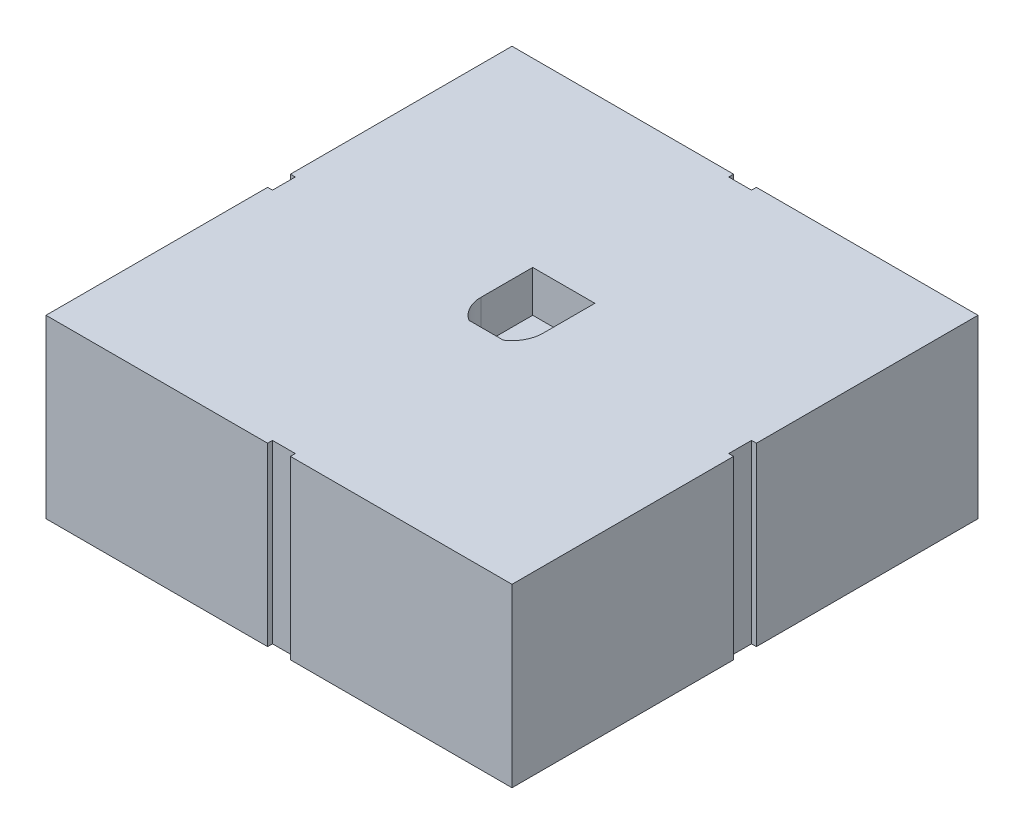
ISO-10303-21;
HEADER;
FILE_DESCRIPTION(('STEP AP214'),'2;1');
FILE_NAME('part.step','',(''),(''),'','','');
FILE_SCHEMA(('AUTOMOTIVE_DESIGN { 1 0 10303 214 1 1 1 1 }'));
ENDSEC;
DATA;
#1=APPLICATION_CONTEXT('core data for automotive mechanical design processes');
#2=APPLICATION_PROTOCOL_DEFINITION('international standard','automotive_design',2000,#1);
#3=PRODUCT_CONTEXT('',#1,'mechanical');
#4=PRODUCT('Part','Part','',(#3));
#5=PRODUCT_RELATED_PRODUCT_CATEGORY('part','',(#4));
#6=PRODUCT_DEFINITION_FORMATION('','',#4);
#7=PRODUCT_DEFINITION_CONTEXT('part definition',#1,'design');
#8=PRODUCT_DEFINITION('design','',#6,#7);
#9=PRODUCT_DEFINITION_SHAPE('','',#8);
#10=(LENGTH_UNIT() NAMED_UNIT(*) SI_UNIT(.MILLI.,.METRE.));
#11=(NAMED_UNIT(*) PLANE_ANGLE_UNIT() SI_UNIT($,.RADIAN.));
#12=(NAMED_UNIT(*) SI_UNIT($,.STERADIAN.) SOLID_ANGLE_UNIT());
#13=UNCERTAINTY_MEASURE_WITH_UNIT(LENGTH_MEASURE(1.E-05),#10,'distance_accuracy_value','');
#14=(GEOMETRIC_REPRESENTATION_CONTEXT(3) GLOBAL_UNCERTAINTY_ASSIGNED_CONTEXT((#13)) GLOBAL_UNIT_ASSIGNED_CONTEXT((#10,
#11,#12)) REPRESENTATION_CONTEXT('',''));
#15=CARTESIAN_POINT('',(0.,0.,0.));
#16=DIRECTION('',(0.,0.,1.));
#17=DIRECTION('',(1.,0.,0.));
#18=AXIS2_PLACEMENT_3D('',#15,#16,#17);
#19=CARTESIAN_POINT('',(0.,54.,0.));
#20=DIRECTION('',(1.,0.,0.));
#21=DIRECTION('',(0.,0.,-1.));
#22=AXIS2_PLACEMENT_3D('',#19,#20,#21);
#23=PLANE('',#22);
#24=DIRECTION('',(0.,0.,1.));
#25=VECTOR('',#24,1.);
#26=CARTESIAN_POINT('',(0.,54.,0.));
#27=LINE('',#26,#25);
#28=CARTESIAN_POINT('',(0.,54.,-67.9000000000008));
#29=VERTEX_POINT('',#28);
#30=CARTESIAN_POINT('',(0.,54.,0.));
#31=VERTEX_POINT('',#30);
#32=EDGE_CURVE('E278',#29,#31,#27,.T.);
#33=ORIENTED_EDGE('',*,*,#32,.F.);
#34=DIRECTION('',(0.,-1.,0.));
#35=VECTOR('',#34,1.);
#36=CARTESIAN_POINT('',(0.,54.,-67.9000000000008));
#37=LINE('',#36,#35);
#38=CARTESIAN_POINT('',(0.,0.,-67.9000000000008));
#39=VERTEX_POINT('',#38);
#40=EDGE_CURVE('E336',#29,#39,#37,.T.);
#41=ORIENTED_EDGE('',*,*,#40,.T.);
#42=DIRECTION('',(0.,0.,1.));
#43=VECTOR('',#42,1.);
#44=CARTESIAN_POINT('',(0.,0.,0.));
#45=LINE('',#44,#43);
#46=CARTESIAN_POINT('',(0.,0.,0.));
#47=VERTEX_POINT('',#46);
#48=EDGE_CURVE('E265',#39,#47,#45,.T.);
#49=ORIENTED_EDGE('',*,*,#48,.T.);
#50=DIRECTION('',(0.,-1.,0.));
#51=VECTOR('',#50,1.);
#52=CARTESIAN_POINT('',(0.,54.,0.));
#53=LINE('',#52,#51);
#54=EDGE_CURVE('E11',#31,#47,#53,.T.);
#55=ORIENTED_EDGE('',*,*,#54,.F.);
#56=EDGE_LOOP('',(#33,#41,#49,#55));
#57=FACE_BOUND('',#56,.T.);
#58=ADVANCED_FACE('F39',(#57),#23,.F.);
#59=CARTESIAN_POINT('',(0.,54.,0.));
#60=DIRECTION('',(0.,0.,-1.));
#61=DIRECTION('',(-1.,0.,0.));
#62=AXIS2_PLACEMENT_3D('',#59,#60,#61);
#63=PLANE('',#62);
#64=DIRECTION('',(1.,0.,0.));
#65=VECTOR('',#64,1.);
#66=CARTESIAN_POINT('',(0.,54.,0.));
#67=LINE('',#66,#65);
#68=CARTESIAN_POINT('',(74.9,54.,0.));
#69=VERTEX_POINT('',#68);
#70=CARTESIAN_POINT('',(142.8,54.,0.));
#71=VERTEX_POINT('',#70);
#72=EDGE_CURVE('E243',#69,#71,#67,.T.);
#73=ORIENTED_EDGE('',*,*,#72,.F.);
#74=DIRECTION('',(0.,-1.,0.));
#75=VECTOR('',#74,1.);
#76=CARTESIAN_POINT('',(74.9,54.,0.));
#77=LINE('',#76,#75);
#78=CARTESIAN_POINT('',(74.9,0.,0.));
#79=VERTEX_POINT('',#78);
#80=EDGE_CURVE('E297',#69,#79,#77,.T.);
#81=ORIENTED_EDGE('',*,*,#80,.T.);
#82=DIRECTION('',(1.,0.,0.));
#83=VECTOR('',#82,1.);
#84=CARTESIAN_POINT('',(0.,0.,0.));
#85=LINE('',#84,#83);
#86=CARTESIAN_POINT('',(142.8,0.,0.));
#87=VERTEX_POINT('',#86);
#88=EDGE_CURVE('E264',#79,#87,#85,.T.);
#89=ORIENTED_EDGE('',*,*,#88,.T.);
#90=DIRECTION('',(0.,-1.,0.));
#91=VECTOR('',#90,1.);
#92=CARTESIAN_POINT('',(142.8,54.,0.));
#93=LINE('',#92,#91);
#94=EDGE_CURVE('E48',#71,#87,#93,.T.);
#95=ORIENTED_EDGE('',*,*,#94,.F.);
#96=EDGE_LOOP('',(#73,#81,#89,#95));
#97=FACE_BOUND('',#96,.T.);
#98=ADVANCED_FACE('F507',(#97),#63,.F.);
#99=CARTESIAN_POINT('',(142.8,54.,0.));
#100=DIRECTION('',(-1.,0.,0.));
#101=DIRECTION('',(0.,0.,1.));
#102=AXIS2_PLACEMENT_3D('',#99,#100,#101);
#103=PLANE('',#102);
#104=DIRECTION('',(0.,0.,-1.));
#105=VECTOR('',#104,1.);
#106=CARTESIAN_POINT('',(142.8,54.,0.));
#107=LINE('',#106,#105);
#108=CARTESIAN_POINT('',(142.8,54.,-74.8999999999998));
#109=VERTEX_POINT('',#108);
#110=CARTESIAN_POINT('',(142.8,54.,-142.8));
#111=VERTEX_POINT('',#110);
#112=EDGE_CURVE('E247',#109,#111,#107,.T.);
#113=ORIENTED_EDGE('',*,*,#112,.F.);
#114=DIRECTION('',(0.,-1.,0.));
#115=VECTOR('',#114,1.);
#116=CARTESIAN_POINT('',(142.8,54.,-74.8999999999998));
#117=LINE('',#116,#115);
#118=CARTESIAN_POINT('',(142.8,0.,-74.8999999999998));
#119=VERTEX_POINT('',#118);
#120=EDGE_CURVE('E310',#109,#119,#117,.T.);
#121=ORIENTED_EDGE('',*,*,#120,.T.);
#122=DIRECTION('',(0.,0.,-1.));
#123=VECTOR('',#122,1.);
#124=CARTESIAN_POINT('',(142.8,0.,0.));
#125=LINE('',#124,#123);
#126=CARTESIAN_POINT('',(142.8,0.,-142.8));
#127=VERTEX_POINT('',#126);
#128=EDGE_CURVE('E270',#119,#127,#125,.T.);
#129=ORIENTED_EDGE('',*,*,#128,.T.);
#130=DIRECTION('',(0.,-1.,0.));
#131=VECTOR('',#130,1.);
#132=CARTESIAN_POINT('',(142.8,54.,-142.8));
#133=LINE('',#132,#131);
#134=EDGE_CURVE('E282',#111,#127,#133,.T.);
#135=ORIENTED_EDGE('',*,*,#134,.F.);
#136=EDGE_LOOP('',(#113,#121,#129,#135));
#137=FACE_BOUND('',#136,.T.);
#138=ADVANCED_FACE('F524',(#137),#103,.F.);
#139=CARTESIAN_POINT('',(0.,54.,-142.8));
#140=DIRECTION('',(0.,0.,1.));
#141=DIRECTION('',(1.,0.,0.));
#142=AXIS2_PLACEMENT_3D('',#139,#140,#141);
#143=PLANE('',#142);
#144=DIRECTION('',(-1.,0.,0.));
#145=VECTOR('',#144,1.);
#146=CARTESIAN_POINT('',(0.,54.,-142.8));
#147=LINE('',#146,#145);
#148=CARTESIAN_POINT('',(67.9,54.,-142.8));
#149=VERTEX_POINT('',#148);
#150=CARTESIAN_POINT('',(0.,54.,-142.8));
#151=VERTEX_POINT('',#150);
#152=EDGE_CURVE('E246',#149,#151,#147,.T.);
#153=ORIENTED_EDGE('',*,*,#152,.F.);
#154=DIRECTION('',(0.,-1.,0.));
#155=VECTOR('',#154,1.);
#156=CARTESIAN_POINT('',(67.9,54.,-142.8));
#157=LINE('',#156,#155);
#158=CARTESIAN_POINT('',(67.9,0.,-142.8));
#159=VERTEX_POINT('',#158);
#160=EDGE_CURVE('E405',#149,#159,#157,.T.);
#161=ORIENTED_EDGE('',*,*,#160,.T.);
#162=DIRECTION('',(-1.,0.,0.));
#163=VECTOR('',#162,1.);
#164=CARTESIAN_POINT('',(0.,0.,-142.8));
#165=LINE('',#164,#163);
#166=CARTESIAN_POINT('',(0.,0.,-142.8));
#167=VERTEX_POINT('',#166);
#168=EDGE_CURVE('E273',#159,#167,#165,.T.);
#169=ORIENTED_EDGE('',*,*,#168,.T.);
#170=DIRECTION('',(0.,-1.,0.));
#171=VECTOR('',#170,1.);
#172=CARTESIAN_POINT('',(0.,54.,-142.8));
#173=LINE('',#172,#171);
#174=EDGE_CURVE('E259',#151,#167,#173,.T.);
#175=ORIENTED_EDGE('',*,*,#174,.F.);
#176=EDGE_LOOP('',(#153,#161,#169,#175));
#177=FACE_BOUND('',#176,.T.);
#178=ADVANCED_FACE('F526',(#177),#143,.F.);
#179=CARTESIAN_POINT('',(0.,0.,-74.9000000000008));
#180=VERTEX_POINT('',#179);
#181=EDGE_CURVE('E260',#167,#180,#45,.T.);
#182=ORIENTED_EDGE('',*,*,#181,.T.);
#183=DIRECTION('',(0.,-1.,0.));
#184=VECTOR('',#183,1.);
#185=CARTESIAN_POINT('',(0.,54.,-74.9000000000008));
#186=LINE('',#185,#184);
#187=CARTESIAN_POINT('',(0.,54.,-74.9000000000008));
#188=VERTEX_POINT('',#187);
#189=EDGE_CURVE('E55',#188,#180,#186,.T.);
#190=ORIENTED_EDGE('',*,*,#189,.F.);
#191=EDGE_CURVE('E481',#151,#188,#27,.T.);
#192=ORIENTED_EDGE('',*,*,#191,.F.);
#193=ORIENTED_EDGE('',*,*,#174,.T.);
#194=EDGE_LOOP('',(#182,#190,#192,#193));
#195=FACE_BOUND('',#194,.T.);
#196=ADVANCED_FACE('F41',(#195),#23,.F.);
#197=CARTESIAN_POINT('',(67.8999999999999,0.,0.));
#198=VERTEX_POINT('',#197);
#199=EDGE_CURVE('E266',#47,#198,#85,.T.);
#200=ORIENTED_EDGE('',*,*,#199,.T.);
#201=DIRECTION('',(0.,-1.,0.));
#202=VECTOR('',#201,1.);
#203=CARTESIAN_POINT('',(67.9,54.,0.));
#204=LINE('',#203,#202);
#205=CARTESIAN_POINT('',(67.9,54.,0.));
#206=VERTEX_POINT('',#205);
#207=EDGE_CURVE('E63',#206,#198,#204,.T.);
#208=ORIENTED_EDGE('',*,*,#207,.F.);
#209=EDGE_CURVE('E253',#31,#206,#67,.T.);
#210=ORIENTED_EDGE('',*,*,#209,.F.);
#211=ORIENTED_EDGE('',*,*,#54,.T.);
#212=EDGE_LOOP('',(#200,#208,#210,#211));
#213=FACE_BOUND('',#212,.T.);
#214=ADVANCED_FACE('F494',(#213),#63,.F.);
#215=CARTESIAN_POINT('',(142.8,0.,-67.8999999999997));
#216=VERTEX_POINT('',#215);
#217=EDGE_CURVE('E236',#87,#216,#125,.T.);
#218=ORIENTED_EDGE('',*,*,#217,.T.);
#219=DIRECTION('',(0.,-1.,0.));
#220=VECTOR('',#219,1.);
#221=CARTESIAN_POINT('',(142.8,54.,-67.8999999999997));
#222=LINE('',#221,#220);
#223=CARTESIAN_POINT('',(142.8,54.,-67.8999999999997));
#224=VERTEX_POINT('',#223);
#225=EDGE_CURVE('E218',#224,#216,#222,.T.);
#226=ORIENTED_EDGE('',*,*,#225,.F.);
#227=EDGE_CURVE('E234',#71,#224,#107,.T.);
#228=ORIENTED_EDGE('',*,*,#227,.F.);
#229=ORIENTED_EDGE('',*,*,#94,.T.);
#230=EDGE_LOOP('',(#218,#226,#228,#229));
#231=FACE_BOUND('',#230,.T.);
#232=ADVANCED_FACE('F232',(#231),#103,.F.);
#233=CARTESIAN_POINT('',(74.9,0.,-142.8));
#234=VERTEX_POINT('',#233);
#235=EDGE_CURVE('E274',#127,#234,#165,.T.);
#236=ORIENTED_EDGE('',*,*,#235,.T.);
#237=DIRECTION('',(0.,-1.,0.));
#238=VECTOR('',#237,1.);
#239=CARTESIAN_POINT('',(74.9,54.,-142.8));
#240=LINE('',#239,#238);
#241=CARTESIAN_POINT('',(74.9,54.,-142.8));
#242=VERTEX_POINT('',#241);
#243=EDGE_CURVE('E395',#242,#234,#240,.T.);
#244=ORIENTED_EDGE('',*,*,#243,.F.);
#245=EDGE_CURVE('E251',#111,#242,#147,.T.);
#246=ORIENTED_EDGE('',*,*,#245,.F.);
#247=ORIENTED_EDGE('',*,*,#134,.T.);
#248=EDGE_LOOP('',(#236,#244,#246,#247));
#249=FACE_BOUND('',#248,.T.);
#250=ADVANCED_FACE('F534',(#249),#143,.F.);
#251=CARTESIAN_POINT('',(0.,54.,0.));
#252=DIRECTION('',(0.,-1.,0.));
#253=DIRECTION('',(0.,0.,-1.));
#254=AXIS2_PLACEMENT_3D('',#251,#252,#253);
#255=PLANE('',#254);
#256=DIRECTION('',(1.,0.,0.));
#257=VECTOR('',#256,1.);
#258=CARTESIAN_POINT('',(0.,54.,-63.4625));
#259=LINE('',#258,#257);
#260=CARTESIAN_POINT('',(66.1348581453108,54.,-63.4625));
#261=VERTEX_POINT('',#260);
#262=CARTESIAN_POINT('',(76.6651418546892,54.,-63.4625));
#263=VERTEX_POINT('',#262);
#264=EDGE_CURVE('E445',#261,#263,#259,.T.);
#265=ORIENTED_EDGE('',*,*,#264,.F.);
#266=CARTESIAN_POINT('',(71.4,54.,-71.4));
#267=DIRECTION('',(0.,1.,0.));
#268=DIRECTION('',(0.,0.,1.));
#269=AXIS2_PLACEMENT_3D('',#266,#267,#268);
#270=CIRCLE('',#269,9.52500000000001);
#271=CARTESIAN_POINT('',(61.875,54.,-71.4));
#272=VERTEX_POINT('',#271);
#273=EDGE_CURVE('E409',#272,#261,#270,.T.);
#274=ORIENTED_EDGE('',*,*,#273,.F.);
#275=DIRECTION('',(0.,0.,-1.));
#276=VECTOR('',#275,1.);
#277=CARTESIAN_POINT('',(61.875,54.,0.));
#278=LINE('',#277,#276);
#279=CARTESIAN_POINT('',(61.875,54.,-87.275));
#280=VERTEX_POINT('',#279);
#281=EDGE_CURVE('E423',#272,#280,#278,.T.);
#282=ORIENTED_EDGE('',*,*,#281,.T.);
#283=DIRECTION('',(-1.,0.,0.));
#284=VECTOR('',#283,1.);
#285=CARTESIAN_POINT('',(0.,54.,-87.275));
#286=LINE('',#285,#284);
#287=CARTESIAN_POINT('',(80.925,54.,-87.275));
#288=VERTEX_POINT('',#287);
#289=EDGE_CURVE('E457',#288,#280,#286,.T.);
#290=ORIENTED_EDGE('',*,*,#289,.F.);
#291=DIRECTION('',(0.,0.,-1.));
#292=VECTOR('',#291,1.);
#293=CARTESIAN_POINT('',(80.925,54.,0.));
#294=LINE('',#293,#292);
#295=CARTESIAN_POINT('',(80.925,54.,-71.4));
#296=VERTEX_POINT('',#295);
#297=EDGE_CURVE('E453',#296,#288,#294,.T.);
#298=ORIENTED_EDGE('',*,*,#297,.F.);
#299=CARTESIAN_POINT('',(71.4,54.,-71.4));
#300=DIRECTION('',(0.,1.,0.));
#301=DIRECTION('',(0.,0.,1.));
#302=AXIS2_PLACEMENT_3D('',#299,#300,#301);
#303=CIRCLE('',#302,9.52500000000001);
#304=EDGE_CURVE('E449',#263,#296,#303,.T.);
#305=ORIENTED_EDGE('',*,*,#304,.F.);
#306=EDGE_LOOP('',(#265,#274,#282,#290,#298,#305));
#307=FACE_BOUND('',#306,.T.);
#308=DIRECTION('',(0.,0.,-1.));
#309=VECTOR('',#308,1.);
#310=CARTESIAN_POINT('',(141.3,54.,-71.3999999999997));
#311=LINE('',#310,#309);
#312=CARTESIAN_POINT('',(141.3,54.,-67.8999999999997));
#313=VERTEX_POINT('',#312);
#314=CARTESIAN_POINT('',(141.3,54.,-74.8999999999998));
#315=VERTEX_POINT('',#314);
#316=EDGE_CURVE('E226',#313,#315,#311,.T.);
#317=ORIENTED_EDGE('',*,*,#316,.T.);
#318=DIRECTION('',(1.,0.,0.));
#319=VECTOR('',#318,1.);
#320=CARTESIAN_POINT('',(142.8,54.,-74.8999999999998));
#321=LINE('',#320,#319);
#322=EDGE_CURVE('E238',#315,#109,#321,.T.);
#323=ORIENTED_EDGE('',*,*,#322,.T.);
#324=ORIENTED_EDGE('',*,*,#112,.T.);
#325=ORIENTED_EDGE('',*,*,#245,.T.);
#326=DIRECTION('',(0.,0.,1.));
#327=VECTOR('',#326,1.);
#328=CARTESIAN_POINT('',(74.9,54.,-142.8));
#329=LINE('',#328,#327);
#330=CARTESIAN_POINT('',(74.9,54.,-141.3));
#331=VERTEX_POINT('',#330);
#332=EDGE_CURVE('E382',#242,#331,#329,.T.);
#333=ORIENTED_EDGE('',*,*,#332,.T.);
#334=DIRECTION('',(-1.,0.,0.));
#335=VECTOR('',#334,1.);
#336=CARTESIAN_POINT('',(71.4,54.,-141.3));
#337=LINE('',#336,#335);
#338=CARTESIAN_POINT('',(67.9,54.,-141.3));
#339=VERTEX_POINT('',#338);
#340=EDGE_CURVE('E386',#331,#339,#337,.T.);
#341=ORIENTED_EDGE('',*,*,#340,.T.);
#342=DIRECTION('',(0.,0.,-1.));
#343=VECTOR('',#342,1.);
#344=CARTESIAN_POINT('',(67.9,54.,-142.8));
#345=LINE('',#344,#343);
#346=EDGE_CURVE('E391',#339,#149,#345,.T.);
#347=ORIENTED_EDGE('',*,*,#346,.T.);
#348=ORIENTED_EDGE('',*,*,#152,.T.);
#349=ORIENTED_EDGE('',*,*,#191,.T.);
#350=DIRECTION('',(1.,0.,0.));
#351=VECTOR('',#350,1.);
#352=CARTESIAN_POINT('',(0.,54.,-74.9000000000008));
#353=LINE('',#352,#351);
#354=CARTESIAN_POINT('',(1.50000000000006,54.,-74.9000000000008));
#355=VERTEX_POINT('',#354);
#356=EDGE_CURVE('E349',#188,#355,#353,.T.);
#357=ORIENTED_EDGE('',*,*,#356,.T.);
#358=DIRECTION('',(0.,0.,1.));
#359=VECTOR('',#358,1.);
#360=CARTESIAN_POINT('',(1.50000000000003,54.,-71.4000000000008));
#361=LINE('',#360,#359);
#362=CARTESIAN_POINT('',(1.5,54.,-67.9000000000008));
#363=VERTEX_POINT('',#362);
#364=EDGE_CURVE('E353',#355,#363,#361,.T.);
#365=ORIENTED_EDGE('',*,*,#364,.T.);
#366=DIRECTION('',(-1.,0.,0.));
#367=VECTOR('',#366,1.);
#368=CARTESIAN_POINT('',(0.,54.,-67.9000000000008));
#369=LINE('',#368,#367);
#370=EDGE_CURVE('E358',#363,#29,#369,.T.);
#371=ORIENTED_EDGE('',*,*,#370,.T.);
#372=ORIENTED_EDGE('',*,*,#32,.T.);
#373=ORIENTED_EDGE('',*,*,#209,.T.);
#374=DIRECTION('',(0.,0.,-1.));
#375=VECTOR('',#374,1.);
#376=CARTESIAN_POINT('',(67.9,54.,0.));
#377=LINE('',#376,#375);
#378=CARTESIAN_POINT('',(67.9,54.,-1.50000000000006));
#379=VERTEX_POINT('',#378);
#380=EDGE_CURVE('E320',#206,#379,#377,.T.);
#381=ORIENTED_EDGE('',*,*,#380,.T.);
#382=DIRECTION('',(1.,0.,0.));
#383=VECTOR('',#382,1.);
#384=CARTESIAN_POINT('',(71.4,54.,-1.50000000000006));
#385=LINE('',#384,#383);
#386=CARTESIAN_POINT('',(74.9,54.,-1.50000000000006));
#387=VERTEX_POINT('',#386);
#388=EDGE_CURVE('E324',#379,#387,#385,.T.);
#389=ORIENTED_EDGE('',*,*,#388,.T.);
#390=DIRECTION('',(0.,0.,1.));
#391=VECTOR('',#390,1.);
#392=CARTESIAN_POINT('',(74.9,54.,0.));
#393=LINE('',#392,#391);
#394=EDGE_CURVE('E329',#387,#69,#393,.T.);
#395=ORIENTED_EDGE('',*,*,#394,.T.);
#396=ORIENTED_EDGE('',*,*,#72,.T.);
#397=ORIENTED_EDGE('',*,*,#227,.T.);
#398=DIRECTION('',(-1.,0.,0.));
#399=VECTOR('',#398,1.);
#400=CARTESIAN_POINT('',(142.8,54.,-67.8999999999997));
#401=LINE('',#400,#399);
#402=EDGE_CURVE('E214',#224,#313,#401,.T.);
#403=ORIENTED_EDGE('',*,*,#402,.T.);
#404=EDGE_LOOP('',(#317,#323,#324,#325,#333,#341,#347,#348,#349,#357,#365,#371,#372,#373,#381,
#389,#395,#396,#397,#403));
#405=FACE_BOUND('',#404,.T.);
#406=ADVANCED_FACE('F240',(#307,#405),#255,.F.);
#407=CARTESIAN_POINT('',(0.,0.,0.));
#408=DIRECTION('',(0.,-1.,0.));
#409=DIRECTION('',(0.,0.,-1.));
#410=AXIS2_PLACEMENT_3D('',#407,#408,#409);
#411=PLANE('',#410);
#412=DIRECTION('',(1.,0.,0.));
#413=VECTOR('',#412,1.);
#414=CARTESIAN_POINT('',(142.8,0.,-74.8999999999998));
#415=LINE('',#414,#413);
#416=CARTESIAN_POINT('',(141.3,0.,-74.8999999999998));
#417=VERTEX_POINT('',#416);
#418=EDGE_CURVE('E227',#417,#119,#415,.T.);
#419=ORIENTED_EDGE('',*,*,#418,.F.);
#420=DIRECTION('',(0.,0.,-1.));
#421=VECTOR('',#420,1.);
#422=CARTESIAN_POINT('',(141.3,0.,-71.3999999999997));
#423=LINE('',#422,#421);
#424=CARTESIAN_POINT('',(141.3,0.,-67.8999999999997));
#425=VERTEX_POINT('',#424);
#426=EDGE_CURVE('E295',#425,#417,#423,.T.);
#427=ORIENTED_EDGE('',*,*,#426,.F.);
#428=DIRECTION('',(-1.,0.,0.));
#429=VECTOR('',#428,1.);
#430=CARTESIAN_POINT('',(142.8,0.,-67.8999999999997));
#431=LINE('',#430,#429);
#432=EDGE_CURVE('E293',#216,#425,#431,.T.);
#433=ORIENTED_EDGE('',*,*,#432,.F.);
#434=ORIENTED_EDGE('',*,*,#217,.F.);
#435=ORIENTED_EDGE('',*,*,#88,.F.);
#436=DIRECTION('',(0.,0.,1.));
#437=VECTOR('',#436,1.);
#438=CARTESIAN_POINT('',(74.9,0.,0.));
#439=LINE('',#438,#437);
#440=CARTESIAN_POINT('',(74.9,0.,-1.50000000000006));
#441=VERTEX_POINT('',#440);
#442=EDGE_CURVE('E325',#441,#79,#439,.T.);
#443=ORIENTED_EDGE('',*,*,#442,.F.);
#444=DIRECTION('',(1.,0.,0.));
#445=VECTOR('',#444,1.);
#446=CARTESIAN_POINT('',(71.4,0.,-1.50000000000006));
#447=LINE('',#446,#445);
#448=CARTESIAN_POINT('',(67.9,0.,-1.50000000000006));
#449=VERTEX_POINT('',#448);
#450=EDGE_CURVE('E335',#449,#441,#447,.T.);
#451=ORIENTED_EDGE('',*,*,#450,.F.);
#452=DIRECTION('',(0.,0.,-1.));
#453=VECTOR('',#452,1.);
#454=CARTESIAN_POINT('',(67.9,0.,0.));
#455=LINE('',#454,#453);
#456=EDGE_CURVE('E332',#198,#449,#455,.T.);
#457=ORIENTED_EDGE('',*,*,#456,.F.);
#458=ORIENTED_EDGE('',*,*,#199,.F.);
#459=ORIENTED_EDGE('',*,*,#48,.F.);
#460=DIRECTION('',(-1.,0.,0.));
#461=VECTOR('',#460,1.);
#462=CARTESIAN_POINT('',(0.,0.,-67.9000000000008));
#463=LINE('',#462,#461);
#464=CARTESIAN_POINT('',(1.5,0.,-67.9000000000008));
#465=VERTEX_POINT('',#464);
#466=EDGE_CURVE('E354',#465,#39,#463,.T.);
#467=ORIENTED_EDGE('',*,*,#466,.F.);
#468=DIRECTION('',(0.,0.,1.));
#469=VECTOR('',#468,1.);
#470=CARTESIAN_POINT('',(1.50000000000003,0.,-71.4000000000008));
#471=LINE('',#470,#469);
#472=CARTESIAN_POINT('',(1.50000000000006,0.,-74.9000000000008));
#473=VERTEX_POINT('',#472);
#474=EDGE_CURVE('E365',#473,#465,#471,.T.);
#475=ORIENTED_EDGE('',*,*,#474,.F.);
#476=DIRECTION('',(1.,0.,0.));
#477=VECTOR('',#476,1.);
#478=CARTESIAN_POINT('',(0.,0.,-74.9000000000008));
#479=LINE('',#478,#477);
#480=EDGE_CURVE('E362',#180,#473,#479,.T.);
#481=ORIENTED_EDGE('',*,*,#480,.F.);
#482=ORIENTED_EDGE('',*,*,#181,.F.);
#483=ORIENTED_EDGE('',*,*,#168,.F.);
#484=DIRECTION('',(0.,0.,-1.));
#485=VECTOR('',#484,1.);
#486=CARTESIAN_POINT('',(67.9,0.,-142.8));
#487=LINE('',#486,#485);
#488=CARTESIAN_POINT('',(67.9,0.,-141.3));
#489=VERTEX_POINT('',#488);
#490=EDGE_CURVE('E387',#489,#159,#487,.T.);
#491=ORIENTED_EDGE('',*,*,#490,.F.);
#492=DIRECTION('',(-1.,0.,0.));
#493=VECTOR('',#492,1.);
#494=CARTESIAN_POINT('',(71.4,0.,-141.3));
#495=LINE('',#494,#493);
#496=CARTESIAN_POINT('',(74.9,0.,-141.3));
#497=VERTEX_POINT('',#496);
#498=EDGE_CURVE('E399',#497,#489,#495,.T.);
#499=ORIENTED_EDGE('',*,*,#498,.F.);
#500=DIRECTION('',(0.,0.,1.));
#501=VECTOR('',#500,1.);
#502=CARTESIAN_POINT('',(74.9,0.,-142.8));
#503=LINE('',#502,#501);
#504=EDGE_CURVE('E314',#234,#497,#503,.T.);
#505=ORIENTED_EDGE('',*,*,#504,.F.);
#506=ORIENTED_EDGE('',*,*,#235,.F.);
#507=ORIENTED_EDGE('',*,*,#128,.F.);
#508=EDGE_LOOP('',(#419,#427,#433,#434,#435,#443,#451,#457,#458,#459,#467,#475,#481,#482,#483,
#491,#499,#505,#506,#507));
#509=FACE_BOUND('',#508,.T.);
#510=ADVANCED_FACE('F290',(#509),#411,.T.);
#511=CARTESIAN_POINT('',(71.4,41.3,-71.4));
#512=DIRECTION('',(0.,1.,0.));
#513=DIRECTION('',(0.,0.,1.));
#514=AXIS2_PLACEMENT_3D('',#511,#512,#513);
#515=CYLINDRICAL_SURFACE('',#514,9.52500000000001);
#516=ORIENTED_EDGE('',*,*,#273,.T.);
#517=DIRECTION('',(0.,1.,0.));
#518=VECTOR('',#517,1.);
#519=CARTESIAN_POINT('',(66.1348581453108,41.3,-63.4625));
#520=LINE('',#519,#518);
#521=CARTESIAN_POINT('',(66.1348581453108,41.3,-63.4625));
#522=VERTEX_POINT('',#521);
#523=EDGE_CURVE('E442',#522,#261,#520,.T.);
#524=ORIENTED_EDGE('',*,*,#523,.F.);
#525=CARTESIAN_POINT('',(71.4,41.3,-71.4));
#526=DIRECTION('',(0.,1.,0.));
#527=DIRECTION('',(0.,0.,1.));
#528=AXIS2_PLACEMENT_3D('',#525,#526,#527);
#529=CIRCLE('',#528,9.52500000000001);
#530=CARTESIAN_POINT('',(61.875,41.3,-71.4));
#531=VERTEX_POINT('',#530);
#532=EDGE_CURVE('E418',#531,#522,#529,.T.);
#533=ORIENTED_EDGE('',*,*,#532,.F.);
#534=DIRECTION('',(0.,1.,0.));
#535=VECTOR('',#534,1.);
#536=CARTESIAN_POINT('',(61.875,41.3,-71.4));
#537=LINE('',#536,#535);
#538=EDGE_CURVE('E464',#531,#272,#537,.T.);
#539=ORIENTED_EDGE('',*,*,#538,.T.);
#540=EDGE_LOOP('',(#516,#524,#533,#539));
#541=FACE_BOUND('',#540,.T.);
#542=ADVANCED_FACE('F573',(#541),#515,.F.);
#543=CARTESIAN_POINT('',(61.875,41.3,0.));
#544=DIRECTION('',(1.,0.,0.));
#545=DIRECTION('',(0.,0.,-1.));
#546=AXIS2_PLACEMENT_3D('',#543,#544,#545);
#547=PLANE('',#546);
#548=ORIENTED_EDGE('',*,*,#281,.F.);
#549=ORIENTED_EDGE('',*,*,#538,.F.);
#550=DIRECTION('',(0.,0.,-1.));
#551=VECTOR('',#550,1.);
#552=CARTESIAN_POINT('',(61.875,41.3,0.));
#553=LINE('',#552,#551);
#554=CARTESIAN_POINT('',(61.875,41.3,-87.275));
#555=VERTEX_POINT('',#554);
#556=EDGE_CURVE('E439',#531,#555,#553,.T.);
#557=ORIENTED_EDGE('',*,*,#556,.T.);
#558=DIRECTION('',(0.,1.,0.));
#559=VECTOR('',#558,1.);
#560=CARTESIAN_POINT('',(61.875,41.3,-87.275));
#561=LINE('',#560,#559);
#562=EDGE_CURVE('E467',#555,#280,#561,.T.);
#563=ORIENTED_EDGE('',*,*,#562,.T.);
#564=EDGE_LOOP('',(#548,#549,#557,#563));
#565=FACE_BOUND('',#564,.T.);
#566=ADVANCED_FACE('F569',(#565),#547,.T.);
#567=CARTESIAN_POINT('',(0.,41.3,-87.275));
#568=DIRECTION('',(0.,0.,-1.));
#569=DIRECTION('',(-1.,0.,0.));
#570=AXIS2_PLACEMENT_3D('',#567,#568,#569);
#571=PLANE('',#570);
#572=ORIENTED_EDGE('',*,*,#289,.T.);
#573=ORIENTED_EDGE('',*,*,#562,.F.);
#574=DIRECTION('',(-1.,0.,0.));
#575=VECTOR('',#574,1.);
#576=CARTESIAN_POINT('',(0.,41.3,-87.275));
#577=LINE('',#576,#575);
#578=CARTESIAN_POINT('',(80.925,41.3,-87.275));
#579=VERTEX_POINT('',#578);
#580=EDGE_CURVE('E435',#579,#555,#577,.T.);
#581=ORIENTED_EDGE('',*,*,#580,.F.);
#582=DIRECTION('',(0.,1.,0.));
#583=VECTOR('',#582,1.);
#584=CARTESIAN_POINT('',(80.925,41.3,-87.275));
#585=LINE('',#584,#583);
#586=EDGE_CURVE('E470',#579,#288,#585,.T.);
#587=ORIENTED_EDGE('',*,*,#586,.T.);
#588=EDGE_LOOP('',(#572,#573,#581,#587));
#589=FACE_BOUND('',#588,.T.);
#590=ADVANCED_FACE('F572',(#589),#571,.F.);
#591=CARTESIAN_POINT('',(80.925,41.3,0.));
#592=DIRECTION('',(1.,0.,0.));
#593=DIRECTION('',(0.,0.,-1.));
#594=AXIS2_PLACEMENT_3D('',#591,#592,#593);
#595=PLANE('',#594);
#596=ORIENTED_EDGE('',*,*,#297,.T.);
#597=ORIENTED_EDGE('',*,*,#586,.F.);
#598=DIRECTION('',(0.,0.,-1.));
#599=VECTOR('',#598,1.);
#600=CARTESIAN_POINT('',(80.925,41.3,0.));
#601=LINE('',#600,#599);
#602=CARTESIAN_POINT('',(80.925,41.3,-71.4));
#603=VERTEX_POINT('',#602);
#604=EDGE_CURVE('E431',#603,#579,#601,.T.);
#605=ORIENTED_EDGE('',*,*,#604,.F.);
#606=DIRECTION('',(0.,1.,0.));
#607=VECTOR('',#606,1.);
#608=CARTESIAN_POINT('',(80.925,41.3,-71.4));
#609=LINE('',#608,#607);
#610=EDGE_CURVE('E473',#603,#296,#609,.T.);
#611=ORIENTED_EDGE('',*,*,#610,.T.);
#612=EDGE_LOOP('',(#596,#597,#605,#611));
#613=FACE_BOUND('',#612,.T.);
#614=ADVANCED_FACE('F577',(#613),#595,.F.);
#615=CARTESIAN_POINT('',(71.4,41.3,-71.4));
#616=DIRECTION('',(0.,1.,0.));
#617=DIRECTION('',(0.,0.,1.));
#618=AXIS2_PLACEMENT_3D('',#615,#616,#617);
#619=CYLINDRICAL_SURFACE('',#618,9.52500000000001);
#620=ORIENTED_EDGE('',*,*,#304,.T.);
#621=ORIENTED_EDGE('',*,*,#610,.F.);
#622=CARTESIAN_POINT('',(71.4,41.3,-71.4));
#623=DIRECTION('',(0.,1.,0.));
#624=DIRECTION('',(0.,0.,1.));
#625=AXIS2_PLACEMENT_3D('',#622,#623,#624);
#626=CIRCLE('',#625,9.52500000000001);
#627=CARTESIAN_POINT('',(76.6651418546892,41.3,-63.4625));
#628=VERTEX_POINT('',#627);
#629=EDGE_CURVE('E427',#628,#603,#626,.T.);
#630=ORIENTED_EDGE('',*,*,#629,.F.);
#631=DIRECTION('',(0.,1.,0.));
#632=VECTOR('',#631,1.);
#633=CARTESIAN_POINT('',(76.6651418546892,41.3,-63.4625));
#634=LINE('',#633,#632);
#635=EDGE_CURVE('E476',#628,#263,#634,.T.);
#636=ORIENTED_EDGE('',*,*,#635,.T.);
#637=EDGE_LOOP('',(#620,#621,#630,#636));
#638=FACE_BOUND('',#637,.T.);
#639=ADVANCED_FACE('F581',(#638),#619,.F.);
#640=CARTESIAN_POINT('',(0.,41.3,-63.4625));
#641=DIRECTION('',(0.,0.,1.));
#642=DIRECTION('',(1.,0.,0.));
#643=AXIS2_PLACEMENT_3D('',#640,#641,#642);
#644=PLANE('',#643);
#645=ORIENTED_EDGE('',*,*,#264,.T.);
#646=ORIENTED_EDGE('',*,*,#635,.F.);
#647=DIRECTION('',(1.,0.,0.));
#648=VECTOR('',#647,1.);
#649=CARTESIAN_POINT('',(0.,41.3,-63.4625));
#650=LINE('',#649,#648);
#651=EDGE_CURVE('E422',#522,#628,#650,.T.);
#652=ORIENTED_EDGE('',*,*,#651,.F.);
#653=ORIENTED_EDGE('',*,*,#523,.T.);
#654=EDGE_LOOP('',(#645,#646,#652,#653));
#655=FACE_BOUND('',#654,.T.);
#656=ADVANCED_FACE('F567',(#655),#644,.F.);
#657=CARTESIAN_POINT('',(0.,41.3,0.));
#658=DIRECTION('',(0.,1.,0.));
#659=DIRECTION('',(0.,0.,1.));
#660=AXIS2_PLACEMENT_3D('',#657,#658,#659);
#661=PLANE('',#660);
#662=ORIENTED_EDGE('',*,*,#532,.T.);
#663=ORIENTED_EDGE('',*,*,#651,.T.);
#664=ORIENTED_EDGE('',*,*,#629,.T.);
#665=ORIENTED_EDGE('',*,*,#604,.T.);
#666=ORIENTED_EDGE('',*,*,#580,.T.);
#667=ORIENTED_EDGE('',*,*,#556,.F.);
#668=EDGE_LOOP('',(#662,#663,#664,#665,#666,#667));
#669=FACE_BOUND('',#668,.T.);
#670=ADVANCED_FACE('F560',(#669),#661,.T.);
#671=CARTESIAN_POINT('',(67.9,54.,-142.8));
#672=DIRECTION('',(-1.,0.,0.));
#673=DIRECTION('',(0.,0.,1.));
#674=AXIS2_PLACEMENT_3D('',#671,#672,#673);
#675=PLANE('',#674);
#676=ORIENTED_EDGE('',*,*,#490,.T.);
#677=ORIENTED_EDGE('',*,*,#160,.F.);
#678=ORIENTED_EDGE('',*,*,#346,.F.);
#679=DIRECTION('',(0.,-1.,0.));
#680=VECTOR('',#679,1.);
#681=CARTESIAN_POINT('',(67.9,54.,-141.3));
#682=LINE('',#681,#680);
#683=EDGE_CURVE('E410',#339,#489,#682,.T.);
#684=ORIENTED_EDGE('',*,*,#683,.T.);
#685=EDGE_LOOP('',(#676,#677,#678,#684));
#686=FACE_BOUND('',#685,.T.);
#687=ADVANCED_FACE('F557',(#686),#675,.F.);
#688=CARTESIAN_POINT('',(71.4,54.,-141.3));
#689=DIRECTION('',(0.,0.,1.));
#690=DIRECTION('',(1.,0.,0.));
#691=AXIS2_PLACEMENT_3D('',#688,#689,#690);
#692=PLANE('',#691);
#693=ORIENTED_EDGE('',*,*,#498,.T.);
#694=ORIENTED_EDGE('',*,*,#683,.F.);
#695=ORIENTED_EDGE('',*,*,#340,.F.);
#696=DIRECTION('',(0.,-1.,0.));
#697=VECTOR('',#696,1.);
#698=CARTESIAN_POINT('',(74.9,54.,-141.3));
#699=LINE('',#698,#697);
#700=EDGE_CURVE('E413',#331,#497,#699,.T.);
#701=ORIENTED_EDGE('',*,*,#700,.T.);
#702=EDGE_LOOP('',(#693,#694,#695,#701));
#703=FACE_BOUND('',#702,.T.);
#704=ADVANCED_FACE('F552',(#703),#692,.F.);
#705=CARTESIAN_POINT('',(74.9,54.,-142.8));
#706=DIRECTION('',(1.,0.,0.));
#707=DIRECTION('',(0.,0.,-1.));
#708=AXIS2_PLACEMENT_3D('',#705,#706,#707);
#709=PLANE('',#708);
#710=ORIENTED_EDGE('',*,*,#504,.T.);
#711=ORIENTED_EDGE('',*,*,#700,.F.);
#712=ORIENTED_EDGE('',*,*,#332,.F.);
#713=ORIENTED_EDGE('',*,*,#243,.T.);
#714=EDGE_LOOP('',(#710,#711,#712,#713));
#715=FACE_BOUND('',#714,.T.);
#716=ADVANCED_FACE('F545',(#715),#709,.F.);
#717=CARTESIAN_POINT('',(0.,54.,-67.9000000000008));
#718=DIRECTION('',(0.,0.,1.));
#719=DIRECTION('',(1.,0.,0.));
#720=AXIS2_PLACEMENT_3D('',#717,#718,#719);
#721=PLANE('',#720);
#722=ORIENTED_EDGE('',*,*,#466,.T.);
#723=ORIENTED_EDGE('',*,*,#40,.F.);
#724=ORIENTED_EDGE('',*,*,#370,.F.);
#725=DIRECTION('',(0.,-1.,0.));
#726=VECTOR('',#725,1.);
#727=CARTESIAN_POINT('',(1.5,54.,-67.9000000000008));
#728=LINE('',#727,#726);
#729=EDGE_CURVE('E374',#363,#465,#728,.T.);
#730=ORIENTED_EDGE('',*,*,#729,.T.);
#731=EDGE_LOOP('',(#722,#723,#724,#730));
#732=FACE_BOUND('',#731,.T.);
#733=ADVANCED_FACE('F543',(#732),#721,.F.);
#734=CARTESIAN_POINT('',(1.50000000000003,54.,-71.4000000000008));
#735=DIRECTION('',(1.,0.,0.));
#736=DIRECTION('',(0.,0.,-1.));
#737=AXIS2_PLACEMENT_3D('',#734,#735,#736);
#738=PLANE('',#737);
#739=ORIENTED_EDGE('',*,*,#474,.T.);
#740=ORIENTED_EDGE('',*,*,#729,.F.);
#741=ORIENTED_EDGE('',*,*,#364,.F.);
#742=DIRECTION('',(0.,-1.,0.));
#743=VECTOR('',#742,1.);
#744=CARTESIAN_POINT('',(1.50000000000006,54.,-74.9000000000008));
#745=LINE('',#744,#743);
#746=EDGE_CURVE('E377',#355,#473,#745,.T.);
#747=ORIENTED_EDGE('',*,*,#746,.T.);
#748=EDGE_LOOP('',(#739,#740,#741,#747));
#749=FACE_BOUND('',#748,.T.);
#750=ADVANCED_FACE('F517',(#749),#738,.F.);
#751=CARTESIAN_POINT('',(0.,54.,-74.9000000000008));
#752=DIRECTION('',(0.,0.,-1.));
#753=DIRECTION('',(-1.,0.,0.));
#754=AXIS2_PLACEMENT_3D('',#751,#752,#753);
#755=PLANE('',#754);
#756=ORIENTED_EDGE('',*,*,#480,.T.);
#757=ORIENTED_EDGE('',*,*,#746,.F.);
#758=ORIENTED_EDGE('',*,*,#356,.F.);
#759=ORIENTED_EDGE('',*,*,#189,.T.);
#760=EDGE_LOOP('',(#756,#757,#758,#759));
#761=FACE_BOUND('',#760,.T.);
#762=ADVANCED_FACE('F510',(#761),#755,.F.);
#763=CARTESIAN_POINT('',(74.9,54.,0.));
#764=DIRECTION('',(1.,0.,0.));
#765=DIRECTION('',(0.,0.,-1.));
#766=AXIS2_PLACEMENT_3D('',#763,#764,#765);
#767=PLANE('',#766);
#768=ORIENTED_EDGE('',*,*,#442,.T.);
#769=ORIENTED_EDGE('',*,*,#80,.F.);
#770=ORIENTED_EDGE('',*,*,#394,.F.);
#771=DIRECTION('',(0.,-1.,0.));
#772=VECTOR('',#771,1.);
#773=CARTESIAN_POINT('',(74.9,54.,-1.50000000000006));
#774=LINE('',#773,#772);
#775=EDGE_CURVE('E303',#387,#441,#774,.T.);
#776=ORIENTED_EDGE('',*,*,#775,.T.);
#777=EDGE_LOOP('',(#768,#769,#770,#776));
#778=FACE_BOUND('',#777,.T.);
#779=ADVANCED_FACE('F508',(#778),#767,.F.);
#780=CARTESIAN_POINT('',(71.4,54.,-1.50000000000006));
#781=DIRECTION('',(0.,0.,-1.));
#782=DIRECTION('',(-1.,0.,0.));
#783=AXIS2_PLACEMENT_3D('',#780,#781,#782);
#784=PLANE('',#783);
#785=ORIENTED_EDGE('',*,*,#450,.T.);
#786=ORIENTED_EDGE('',*,*,#775,.F.);
#787=ORIENTED_EDGE('',*,*,#388,.F.);
#788=DIRECTION('',(0.,-1.,0.));
#789=VECTOR('',#788,1.);
#790=CARTESIAN_POINT('',(67.9,54.,-1.50000000000006));
#791=LINE('',#790,#789);
#792=EDGE_CURVE('E344',#379,#449,#791,.T.);
#793=ORIENTED_EDGE('',*,*,#792,.T.);
#794=EDGE_LOOP('',(#785,#786,#787,#793));
#795=FACE_BOUND('',#794,.T.);
#796=ADVANCED_FACE('F504',(#795),#784,.F.);
#797=CARTESIAN_POINT('',(67.9,54.,0.));
#798=DIRECTION('',(-1.,0.,0.));
#799=DIRECTION('',(0.,0.,1.));
#800=AXIS2_PLACEMENT_3D('',#797,#798,#799);
#801=PLANE('',#800);
#802=ORIENTED_EDGE('',*,*,#456,.T.);
#803=ORIENTED_EDGE('',*,*,#792,.F.);
#804=ORIENTED_EDGE('',*,*,#380,.F.);
#805=ORIENTED_EDGE('',*,*,#207,.T.);
#806=EDGE_LOOP('',(#802,#803,#804,#805));
#807=FACE_BOUND('',#806,.T.);
#808=ADVANCED_FACE('F501',(#807),#801,.F.);
#809=CARTESIAN_POINT('',(142.8,54.,-74.8999999999998));
#810=DIRECTION('',(0.,0.,-1.));
#811=DIRECTION('',(-1.,0.,0.));
#812=AXIS2_PLACEMENT_3D('',#809,#810,#811);
#813=PLANE('',#812);
#814=ORIENTED_EDGE('',*,*,#418,.T.);
#815=ORIENTED_EDGE('',*,*,#120,.F.);
#816=ORIENTED_EDGE('',*,*,#322,.F.);
#817=DIRECTION('',(0.,-1.,0.));
#818=VECTOR('',#817,1.);
#819=CARTESIAN_POINT('',(141.3,54.,-74.8999999999998));
#820=LINE('',#819,#818);
#821=EDGE_CURVE('E315',#315,#417,#820,.T.);
#822=ORIENTED_EDGE('',*,*,#821,.T.);
#823=EDGE_LOOP('',(#814,#815,#816,#822));
#824=FACE_BOUND('',#823,.T.);
#825=ADVANCED_FACE('F625',(#824),#813,.F.);
#826=CARTESIAN_POINT('',(141.3,54.,-71.3999999999997));
#827=DIRECTION('',(-1.,0.,0.));
#828=DIRECTION('',(0.,0.,1.));
#829=AXIS2_PLACEMENT_3D('',#826,#827,#828);
#830=PLANE('',#829);
#831=ORIENTED_EDGE('',*,*,#426,.T.);
#832=ORIENTED_EDGE('',*,*,#821,.F.);
#833=ORIENTED_EDGE('',*,*,#316,.F.);
#834=DIRECTION('',(0.,-1.,0.));
#835=VECTOR('',#834,1.);
#836=CARTESIAN_POINT('',(141.3,54.,-67.8999999999997));
#837=LINE('',#836,#835);
#838=EDGE_CURVE('E220',#313,#425,#837,.T.);
#839=ORIENTED_EDGE('',*,*,#838,.T.);
#840=EDGE_LOOP('',(#831,#832,#833,#839));
#841=FACE_BOUND('',#840,.T.);
#842=ADVANCED_FACE('F627',(#841),#830,.F.);
#843=CARTESIAN_POINT('',(142.8,54.,-67.8999999999997));
#844=DIRECTION('',(0.,0.,1.));
#845=DIRECTION('',(1.,0.,0.));
#846=AXIS2_PLACEMENT_3D('',#843,#844,#845);
#847=PLANE('',#846);
#848=ORIENTED_EDGE('',*,*,#432,.T.);
#849=ORIENTED_EDGE('',*,*,#838,.F.);
#850=ORIENTED_EDGE('',*,*,#402,.F.);
#851=ORIENTED_EDGE('',*,*,#225,.T.);
#852=EDGE_LOOP('',(#848,#849,#850,#851));
#853=FACE_BOUND('',#852,.T.);
#854=ADVANCED_FACE('F217',(#853),#847,.F.);
#855=CLOSED_SHELL('',(#58,#98,#138,#178,#196,#214,#232,#250,#406,#510,#542,#566,#590,#614,#639,
#656,#670,#687,#704,#716,#733,#750,#762,#779,#796,#808,#825,#842,#854));
#856=MANIFOLD_SOLID_BREP('B2',#855);
#857=ADVANCED_BREP_SHAPE_REPRESENTATION('',(#18,#856),#14);
#858=SHAPE_DEFINITION_REPRESENTATION(#9,#857);
ENDSEC;
END-ISO-10303-21;
